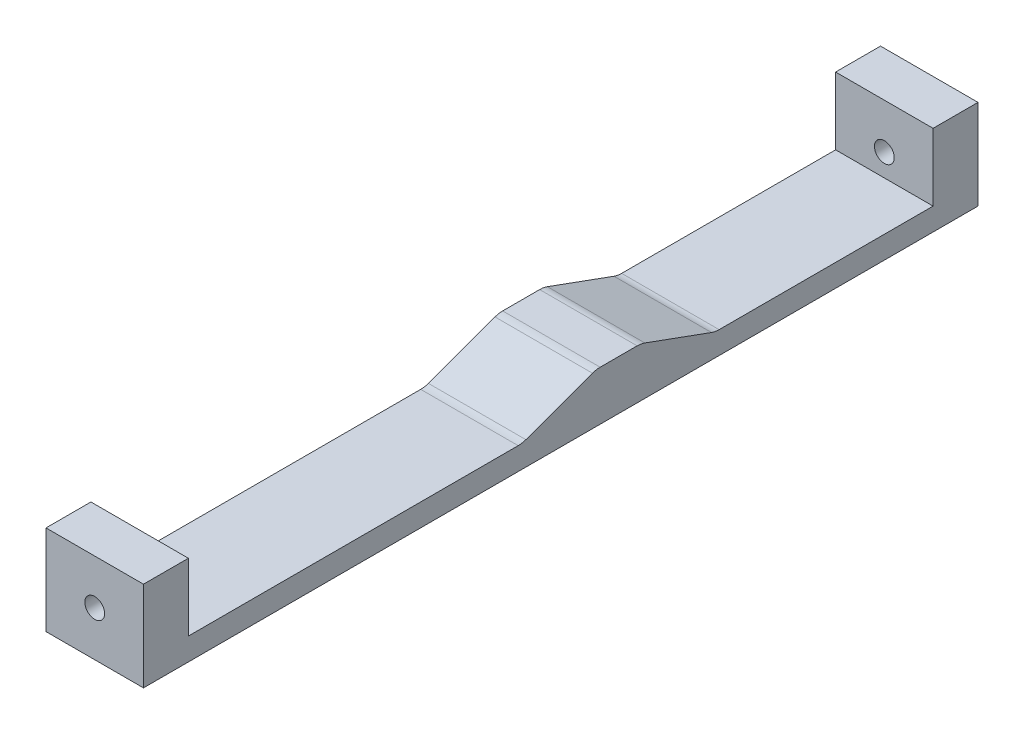
ISO-10303-21;
HEADER;
FILE_DESCRIPTION(('STEP AP214'),'2;1');
FILE_NAME('part.step','',(''),(''),'','','');
FILE_SCHEMA(('AUTOMOTIVE_DESIGN { 1 0 10303 214 1 1 1 1 }'));
ENDSEC;
DATA;
#1=APPLICATION_CONTEXT('core data for automotive mechanical design processes');
#2=APPLICATION_PROTOCOL_DEFINITION('international standard','automotive_design',2000,#1);
#3=PRODUCT_CONTEXT('',#1,'mechanical');
#4=PRODUCT('Part','Part','',(#3));
#5=PRODUCT_RELATED_PRODUCT_CATEGORY('part','',(#4));
#6=PRODUCT_DEFINITION_FORMATION('','',#4);
#7=PRODUCT_DEFINITION_CONTEXT('part definition',#1,'design');
#8=PRODUCT_DEFINITION('design','',#6,#7);
#9=PRODUCT_DEFINITION_SHAPE('','',#8);
#10=(LENGTH_UNIT() NAMED_UNIT(*) SI_UNIT(.MILLI.,.METRE.));
#11=(NAMED_UNIT(*) PLANE_ANGLE_UNIT() SI_UNIT($,.RADIAN.));
#12=(NAMED_UNIT(*) SI_UNIT($,.STERADIAN.) SOLID_ANGLE_UNIT());
#13=UNCERTAINTY_MEASURE_WITH_UNIT(LENGTH_MEASURE(1.E-05),#10,'distance_accuracy_value','');
#14=(GEOMETRIC_REPRESENTATION_CONTEXT(3) GLOBAL_UNCERTAINTY_ASSIGNED_CONTEXT((#13)) GLOBAL_UNIT_ASSIGNED_CONTEXT((#10,
#11,#12)) REPRESENTATION_CONTEXT('',''));
#15=CARTESIAN_POINT('',(0.,0.,0.));
#16=DIRECTION('',(0.,0.,1.));
#17=DIRECTION('',(1.,0.,0.));
#18=AXIS2_PLACEMENT_3D('',#15,#16,#17);
#19=CARTESIAN_POINT('',(0.,3.175,0.));
#20=DIRECTION('',(0.,-1.,0.));
#21=DIRECTION('',(0.,0.,-1.));
#22=AXIS2_PLACEMENT_3D('',#19,#20,#21);
#23=PLANE('',#22);
#24=DIRECTION('',(0.,0.,1.));
#25=VECTOR('',#24,1.);
#26=CARTESIAN_POINT('',(-6.88975,3.175,58.98650001));
#27=LINE('',#26,#25);
#28=CARTESIAN_POINT('',(-6.88975,3.175,-52.63650001));
#29=VERTEX_POINT('',#28);
#30=CARTESIAN_POINT('',(-6.88975,3.175,-22.3892271418717));
#31=VERTEX_POINT('',#30);
#32=EDGE_CURVE('E177',#29,#31,#27,.T.);
#33=ORIENTED_EDGE('',*,*,#32,.T.);
#34=DIRECTION('',(-1.,0.,0.));
#35=VECTOR('',#34,1.);
#36=CARTESIAN_POINT('',(0.,3.175,-22.3892271418717));
#37=LINE('',#36,#35);
#38=CARTESIAN_POINT('',(6.88975,3.175,-22.3892271418717));
#39=VERTEX_POINT('',#38);
#40=EDGE_CURVE('E263',#31,#39,#37,.F.);
#41=ORIENTED_EDGE('',*,*,#40,.T.);
#42=DIRECTION('',(0.,0.,-1.));
#43=VECTOR('',#42,1.);
#44=CARTESIAN_POINT('',(6.88975,3.175,58.98650001));
#45=LINE('',#44,#43);
#46=CARTESIAN_POINT('',(6.88975,3.175,-52.63650001));
#47=VERTEX_POINT('',#46);
#48=EDGE_CURVE('E213',#39,#47,#45,.T.);
#49=ORIENTED_EDGE('',*,*,#48,.T.);
#50=DIRECTION('',(1.,0.,0.));
#51=VECTOR('',#50,1.);
#52=CARTESIAN_POINT('',(-6.88975,3.175,-52.63650001));
#53=LINE('',#52,#51);
#54=EDGE_CURVE('E171',#29,#47,#53,.T.);
#55=ORIENTED_EDGE('',*,*,#54,.F.);
#56=EDGE_LOOP('',(#33,#41,#49,#55));
#57=FACE_BOUND('',#56,.T.);
#58=ADVANCED_FACE('F37',(#57),#23,.F.);
#59=CARTESIAN_POINT('',(6.88975,3.175,58.98650001));
#60=DIRECTION('',(-1.,0.,0.));
#61=DIRECTION('',(0.,0.,1.));
#62=AXIS2_PLACEMENT_3D('',#59,#60,#61);
#63=PLANE('',#62);
#64=DIRECTION('',(0.,0.,1.));
#65=VECTOR('',#64,1.);
#66=CARTESIAN_POINT('',(6.88975,6.985,-11.36150001));
#67=LINE('',#66,#65);
#68=CARTESIAN_POINT('',(6.88975,6.985,-10.8016618462506));
#69=VERTEX_POINT('',#68);
#70=CARTESIAN_POINT('',(6.88975,6.985,-5.57133817374936));
#71=VERTEX_POINT('',#70);
#72=EDGE_CURVE('E279',#69,#71,#67,.T.);
#73=ORIENTED_EDGE('',*,*,#72,.T.);
#74=CARTESIAN_POINT('',(6.88975,3.81,-5.57133817374936));
#75=DIRECTION('',(-1.,0.,0.));
#76=DIRECTION('',(0.,0.,1.));
#77=AXIS2_PLACEMENT_3D('',#74,#75,#76);
#78=CIRCLE('',#77,3.175);
#79=CARTESIAN_POINT('',(6.88975,6.79352407099527,-4.48542421869038));
#80=VERTEX_POINT('',#79);
#81=EDGE_CURVE('E257',#71,#80,#78,.F.);
#82=ORIENTED_EDGE('',*,*,#81,.T.);
#83=DIRECTION('',(0.,-0.342020143325663,0.939692620785911));
#84=VECTOR('',#83,1.);
#85=CARTESIAN_POINT('',(6.88975,3.175,5.45638895812232));
#86=LINE('',#85,#84);
#87=CARTESIAN_POINT('',(6.88975,3.36647592900473,4.93031316681271));
#88=VERTEX_POINT('',#87);
#89=EDGE_CURVE('E283',#80,#88,#86,.T.);
#90=ORIENTED_EDGE('',*,*,#89,.T.);
#91=CARTESIAN_POINT('',(6.88975,6.35,6.01622712187169));
#92=DIRECTION('',(-1.,0.,0.));
#93=DIRECTION('',(0.,0.,1.));
#94=AXIS2_PLACEMENT_3D('',#91,#92,#93);
#95=CIRCLE('',#94,3.175);
#96=CARTESIAN_POINT('',(6.88975,3.175,6.01622712187169));
#97=VERTEX_POINT('',#96);
#98=EDGE_CURVE('E267',#88,#97,#95,.T.);
#99=ORIENTED_EDGE('',*,*,#98,.T.);
#100=CARTESIAN_POINT('',(6.88975,3.175,52.63650001));
#101=VERTEX_POINT('',#100);
#102=EDGE_CURVE('E209',#101,#97,#45,.T.);
#103=ORIENTED_EDGE('',*,*,#102,.F.);
#104=DIRECTION('',(0.,1.,0.));
#105=VECTOR('',#104,1.);
#106=CARTESIAN_POINT('',(6.88975,3.175,52.63650001));
#107=LINE('',#106,#105);
#108=CARTESIAN_POINT('',(6.88975,12.7,52.63650001));
#109=VERTEX_POINT('',#108);
#110=EDGE_CURVE('E194',#101,#109,#107,.T.);
#111=ORIENTED_EDGE('',*,*,#110,.T.);
#112=DIRECTION('',(0.,0.,1.));
#113=VECTOR('',#112,1.);
#114=CARTESIAN_POINT('',(6.88975,12.7,52.63650001));
#115=LINE('',#114,#113);
#116=CARTESIAN_POINT('',(6.88975,12.7,58.98650001));
#117=VERTEX_POINT('',#116);
#118=EDGE_CURVE('E200',#109,#117,#115,.T.);
#119=ORIENTED_EDGE('',*,*,#118,.T.);
#120=DIRECTION('',(0.,-1.,0.));
#121=VECTOR('',#120,1.);
#122=CARTESIAN_POINT('',(6.88975,3.175,58.98650001));
#123=LINE('',#122,#121);
#124=CARTESIAN_POINT('',(6.88975,0.,58.98650001));
#125=VERTEX_POINT('',#124);
#126=EDGE_CURVE('E215',#117,#125,#123,.T.);
#127=ORIENTED_EDGE('',*,*,#126,.T.);
#128=DIRECTION('',(0.,0.,-1.));
#129=VECTOR('',#128,1.);
#130=CARTESIAN_POINT('',(6.88975,0.,58.98650001));
#131=LINE('',#130,#129);
#132=CARTESIAN_POINT('',(6.88975,0.,-58.98650001));
#133=VERTEX_POINT('',#132);
#134=EDGE_CURVE('E206',#125,#133,#131,.T.);
#135=ORIENTED_EDGE('',*,*,#134,.T.);
#136=DIRECTION('',(0.,-1.,0.));
#137=VECTOR('',#136,1.);
#138=CARTESIAN_POINT('',(6.88975,3.175,-58.98650001));
#139=LINE('',#138,#137);
#140=CARTESIAN_POINT('',(6.88975,12.7,-58.98650001));
#141=VERTEX_POINT('',#140);
#142=EDGE_CURVE('E231',#141,#133,#139,.T.);
#143=ORIENTED_EDGE('',*,*,#142,.F.);
#144=DIRECTION('',(0.,0.,-1.));
#145=VECTOR('',#144,1.);
#146=CARTESIAN_POINT('',(6.88975,12.7,-52.63650001));
#147=LINE('',#146,#145);
#148=CARTESIAN_POINT('',(6.88975,12.7,-52.63650001));
#149=VERTEX_POINT('',#148);
#150=EDGE_CURVE('E170',#149,#141,#147,.T.);
#151=ORIENTED_EDGE('',*,*,#150,.F.);
#152=DIRECTION('',(0.,1.,0.));
#153=VECTOR('',#152,1.);
#154=CARTESIAN_POINT('',(6.88975,3.175,-52.63650001));
#155=LINE('',#154,#153);
#156=EDGE_CURVE('E157',#47,#149,#155,.T.);
#157=ORIENTED_EDGE('',*,*,#156,.F.);
#158=ORIENTED_EDGE('',*,*,#48,.F.);
#159=CARTESIAN_POINT('',(6.88975,6.35,-22.3892271418717));
#160=DIRECTION('',(-1.,0.,0.));
#161=DIRECTION('',(0.,0.,1.));
#162=AXIS2_PLACEMENT_3D('',#159,#160,#161);
#163=CIRCLE('',#162,3.175);
#164=CARTESIAN_POINT('',(6.88975,3.36647592900473,-21.3033131868127));
#165=VERTEX_POINT('',#164);
#166=EDGE_CURVE('E11',#39,#165,#163,.T.);
#167=ORIENTED_EDGE('',*,*,#166,.T.);
#168=DIRECTION('',(0.,0.342020143325663,0.939692620785911));
#169=VECTOR('',#168,1.);
#170=CARTESIAN_POINT('',(6.88975,6.985,-11.36150001));
#171=LINE('',#170,#169);
#172=CARTESIAN_POINT('',(6.88975,6.79352407099527,-11.8875758013096));
#173=VERTEX_POINT('',#172);
#174=EDGE_CURVE('E276',#165,#173,#171,.T.);
#175=ORIENTED_EDGE('',*,*,#174,.T.);
#176=CARTESIAN_POINT('',(6.88975,3.81,-10.8016618462506));
#177=DIRECTION('',(-1.,0.,0.));
#178=DIRECTION('',(0.,0.,1.));
#179=AXIS2_PLACEMENT_3D('',#176,#177,#178);
#180=CIRCLE('',#179,3.175);
#181=EDGE_CURVE('E255',#173,#69,#180,.F.);
#182=ORIENTED_EDGE('',*,*,#181,.T.);
#183=EDGE_LOOP('',(#73,#82,#90,#99,#103,#111,#119,#127,#135,#143,#151,#157,#158,#167,#175,#182));
#184=FACE_BOUND('',#183,.T.);
#185=ADVANCED_FACE('F313',(#184),#63,.F.);
#186=CARTESIAN_POINT('',(-6.88975,3.175,-58.98650001));
#187=DIRECTION('',(0.,0.,1.));
#188=DIRECTION('',(1.,0.,0.));
#189=AXIS2_PLACEMENT_3D('',#186,#187,#188);
#190=PLANE('',#189);
#191=CARTESIAN_POINT('',(0.,6.35,-58.98650001));
#192=DIRECTION('',(0.,0.,1.));
#193=DIRECTION('',(1.,0.,0.));
#194=AXIS2_PLACEMENT_3D('',#191,#192,#193);
#195=CIRCLE('',#194,1.399999994);
#196=CARTESIAN_POINT('',(1.399999994,6.35,-58.98650001));
#197=VERTEX_POINT('',#196);
#198=EDGE_CURVE('E238',#197,#197,#195,.T.);
#199=ORIENTED_EDGE('',*,*,#198,.T.);
#200=EDGE_LOOP('',(#199));
#201=FACE_BOUND('',#200,.T.);
#202=DIRECTION('',(-1.,0.,0.));
#203=VECTOR('',#202,1.);
#204=CARTESIAN_POINT('',(-6.88975,0.,-58.98650001));
#205=LINE('',#204,#203);
#206=CARTESIAN_POINT('',(-6.88975,0.,-58.98650001));
#207=VERTEX_POINT('',#206);
#208=EDGE_CURVE('E218',#133,#207,#205,.T.);
#209=ORIENTED_EDGE('',*,*,#208,.T.);
#210=DIRECTION('',(0.,-1.,0.));
#211=VECTOR('',#210,1.);
#212=CARTESIAN_POINT('',(-6.88975,3.175,-58.98650001));
#213=LINE('',#212,#211);
#214=CARTESIAN_POINT('',(-6.88975,12.7,-58.98650001));
#215=VERTEX_POINT('',#214);
#216=EDGE_CURVE('E229',#215,#207,#213,.T.);
#217=ORIENTED_EDGE('',*,*,#216,.F.);
#218=DIRECTION('',(-1.,0.,0.));
#219=VECTOR('',#218,1.);
#220=CARTESIAN_POINT('',(-6.88975,12.7,-58.98650001));
#221=LINE('',#220,#219);
#222=EDGE_CURVE('E167',#141,#215,#221,.T.);
#223=ORIENTED_EDGE('',*,*,#222,.F.);
#224=ORIENTED_EDGE('',*,*,#142,.T.);
#225=EDGE_LOOP('',(#209,#217,#223,#224));
#226=FACE_BOUND('',#225,.T.);
#227=ADVANCED_FACE('F296',(#201,#226),#190,.F.);
#228=CARTESIAN_POINT('',(-6.88975,3.175,58.98650001));
#229=DIRECTION('',(1.,0.,0.));
#230=DIRECTION('',(0.,0.,-1.));
#231=AXIS2_PLACEMENT_3D('',#228,#229,#230);
#232=PLANE('',#231);
#233=DIRECTION('',(0.,0.342020143325663,-0.93969262078591));
#234=VECTOR('',#233,1.);
#235=CARTESIAN_POINT('',(-6.88975,3.175,5.45638895812232));
#236=LINE('',#235,#234);
#237=CARTESIAN_POINT('',(-6.88975,3.36647592900473,4.93031316681271));
#238=VERTEX_POINT('',#237);
#239=CARTESIAN_POINT('',(-6.88975,6.79352407099527,-4.48542421869038));
#240=VERTEX_POINT('',#239);
#241=EDGE_CURVE('E288',#238,#240,#236,.T.);
#242=ORIENTED_EDGE('',*,*,#241,.T.);
#243=CARTESIAN_POINT('',(-6.88975,3.81,-5.57133817374936));
#244=DIRECTION('',(1.,0.,0.));
#245=DIRECTION('',(0.,0.,-1.));
#246=AXIS2_PLACEMENT_3D('',#243,#244,#245);
#247=CIRCLE('',#246,3.175);
#248=CARTESIAN_POINT('',(-6.88975,6.985,-5.57133817374936));
#249=VERTEX_POINT('',#248);
#250=EDGE_CURVE('E248',#240,#249,#247,.F.);
#251=ORIENTED_EDGE('',*,*,#250,.T.);
#252=DIRECTION('',(0.,0.,-1.));
#253=VECTOR('',#252,1.);
#254=CARTESIAN_POINT('',(-6.88975,6.985,-11.36150001));
#255=LINE('',#254,#253);
#256=CARTESIAN_POINT('',(-6.88975,6.985,-10.8016618462506));
#257=VERTEX_POINT('',#256);
#258=EDGE_CURVE('E290',#249,#257,#255,.T.);
#259=ORIENTED_EDGE('',*,*,#258,.T.);
#260=CARTESIAN_POINT('',(-6.88975,3.81,-10.8016618462506));
#261=DIRECTION('',(1.,0.,0.));
#262=DIRECTION('',(0.,0.,-1.));
#263=AXIS2_PLACEMENT_3D('',#260,#261,#262);
#264=CIRCLE('',#263,3.175);
#265=CARTESIAN_POINT('',(-6.88975,6.79352407099527,-11.8875758013096));
#266=VERTEX_POINT('',#265);
#267=EDGE_CURVE('E246',#257,#266,#264,.F.);
#268=ORIENTED_EDGE('',*,*,#267,.T.);
#269=DIRECTION('',(0.,-0.342020143325663,-0.93969262078591));
#270=VECTOR('',#269,1.);
#271=CARTESIAN_POINT('',(-6.88975,6.985,-11.36150001));
#272=LINE('',#271,#270);
#273=CARTESIAN_POINT('',(-6.88975,3.36647592900473,-21.3033131868127));
#274=VERTEX_POINT('',#273);
#275=EDGE_CURVE('E269',#266,#274,#272,.T.);
#276=ORIENTED_EDGE('',*,*,#275,.T.);
#277=CARTESIAN_POINT('',(-6.88975,6.35,-22.3892271418717));
#278=DIRECTION('',(1.,0.,0.));
#279=DIRECTION('',(0.,0.,-1.));
#280=AXIS2_PLACEMENT_3D('',#277,#278,#279);
#281=CIRCLE('',#280,3.175);
#282=EDGE_CURVE('E45',#274,#31,#281,.T.);
#283=ORIENTED_EDGE('',*,*,#282,.T.);
#284=ORIENTED_EDGE('',*,*,#32,.F.);
#285=DIRECTION('',(0.,-1.,0.));
#286=VECTOR('',#285,1.);
#287=CARTESIAN_POINT('',(-6.88975,3.175,-52.63650001));
#288=LINE('',#287,#286);
#289=CARTESIAN_POINT('',(-6.88975,12.7,-52.63650001));
#290=VERTEX_POINT('',#289);
#291=EDGE_CURVE('E155',#290,#29,#288,.T.);
#292=ORIENTED_EDGE('',*,*,#291,.F.);
#293=DIRECTION('',(0.,0.,-1.));
#294=VECTOR('',#293,1.);
#295=CARTESIAN_POINT('',(-6.88975,12.7,-52.63650001));
#296=LINE('',#295,#294);
#297=EDGE_CURVE('E164',#290,#215,#296,.T.);
#298=ORIENTED_EDGE('',*,*,#297,.T.);
#299=ORIENTED_EDGE('',*,*,#216,.T.);
#300=DIRECTION('',(0.,0.,1.));
#301=VECTOR('',#300,1.);
#302=CARTESIAN_POINT('',(-6.88975,0.,58.98650001));
#303=LINE('',#302,#301);
#304=CARTESIAN_POINT('',(-6.88975,0.,58.98650001));
#305=VERTEX_POINT('',#304);
#306=EDGE_CURVE('E220',#207,#305,#303,.T.);
#307=ORIENTED_EDGE('',*,*,#306,.T.);
#308=DIRECTION('',(0.,-1.,0.));
#309=VECTOR('',#308,1.);
#310=CARTESIAN_POINT('',(-6.88975,3.175,58.98650001));
#311=LINE('',#310,#309);
#312=CARTESIAN_POINT('',(-6.88975,12.7,58.98650001));
#313=VERTEX_POINT('',#312);
#314=EDGE_CURVE('E226',#313,#305,#311,.T.);
#315=ORIENTED_EDGE('',*,*,#314,.F.);
#316=DIRECTION('',(0.,0.,1.));
#317=VECTOR('',#316,1.);
#318=CARTESIAN_POINT('',(-6.88975,12.7,52.63650001));
#319=LINE('',#318,#317);
#320=CARTESIAN_POINT('',(-6.88975,12.7,52.63650001));
#321=VERTEX_POINT('',#320);
#322=EDGE_CURVE('E203',#321,#313,#319,.T.);
#323=ORIENTED_EDGE('',*,*,#322,.F.);
#324=DIRECTION('',(0.,-1.,0.));
#325=VECTOR('',#324,1.);
#326=CARTESIAN_POINT('',(-6.88975,3.175,52.63650001));
#327=LINE('',#326,#325);
#328=CARTESIAN_POINT('',(-6.88975,3.175,52.63650001));
#329=VERTEX_POINT('',#328);
#330=EDGE_CURVE('E188',#321,#329,#327,.T.);
#331=ORIENTED_EDGE('',*,*,#330,.T.);
#332=CARTESIAN_POINT('',(-6.88975,3.175,6.01622712187169));
#333=VERTEX_POINT('',#332);
#334=EDGE_CURVE('E212',#333,#329,#27,.T.);
#335=ORIENTED_EDGE('',*,*,#334,.F.);
#336=CARTESIAN_POINT('',(-6.88975,6.35,6.01622712187169));
#337=DIRECTION('',(1.,0.,0.));
#338=DIRECTION('',(0.,0.,-1.));
#339=AXIS2_PLACEMENT_3D('',#336,#337,#338);
#340=CIRCLE('',#339,3.175);
#341=EDGE_CURVE('E265',#333,#238,#340,.T.);
#342=ORIENTED_EDGE('',*,*,#341,.T.);
#343=EDGE_LOOP('',(#242,#251,#259,#268,#276,#283,#284,#292,#298,#299,#307,#315,#323,#331,#335,#342));
#344=FACE_BOUND('',#343,.T.);
#345=ADVANCED_FACE('F175',(#344),#232,.F.);
#346=CARTESIAN_POINT('',(-6.88975,3.175,58.98650001));
#347=DIRECTION('',(0.,0.,-1.));
#348=DIRECTION('',(-1.,0.,0.));
#349=AXIS2_PLACEMENT_3D('',#346,#347,#348);
#350=PLANE('',#349);
#351=CARTESIAN_POINT('',(0.,6.35,58.98650001));
#352=DIRECTION('',(0.,0.,1.));
#353=DIRECTION('',(1.,0.,0.));
#354=AXIS2_PLACEMENT_3D('',#351,#352,#353);
#355=CIRCLE('',#354,1.399999994);
#356=CARTESIAN_POINT('',(1.399999994,6.35,58.98650001));
#357=VERTEX_POINT('',#356);
#358=EDGE_CURVE('E278',#357,#357,#355,.T.);
#359=ORIENTED_EDGE('',*,*,#358,.F.);
#360=EDGE_LOOP('',(#359));
#361=FACE_BOUND('',#360,.T.);
#362=DIRECTION('',(1.,0.,0.));
#363=VECTOR('',#362,1.);
#364=CARTESIAN_POINT('',(-6.88975,0.,58.98650001));
#365=LINE('',#364,#363);
#366=EDGE_CURVE('E222',#305,#125,#365,.T.);
#367=ORIENTED_EDGE('',*,*,#366,.T.);
#368=ORIENTED_EDGE('',*,*,#126,.F.);
#369=DIRECTION('',(-1.,0.,0.));
#370=VECTOR('',#369,1.);
#371=CARTESIAN_POINT('',(-6.88975,12.7,58.98650001));
#372=LINE('',#371,#370);
#373=EDGE_CURVE('E186',#117,#313,#372,.T.);
#374=ORIENTED_EDGE('',*,*,#373,.T.);
#375=ORIENTED_EDGE('',*,*,#314,.T.);
#376=EDGE_LOOP('',(#367,#368,#374,#375));
#377=FACE_BOUND('',#376,.T.);
#378=ADVANCED_FACE('F324',(#361,#377),#350,.F.);
#379=ORIENTED_EDGE('',*,*,#102,.T.);
#380=DIRECTION('',(-1.,0.,0.));
#381=VECTOR('',#380,1.);
#382=CARTESIAN_POINT('',(0.,3.175,6.01622712187169));
#383=LINE('',#382,#381);
#384=EDGE_CURVE('E234',#97,#333,#383,.T.);
#385=ORIENTED_EDGE('',*,*,#384,.T.);
#386=ORIENTED_EDGE('',*,*,#334,.T.);
#387=DIRECTION('',(1.,0.,0.));
#388=VECTOR('',#387,1.);
#389=CARTESIAN_POINT('',(-6.88975,3.175,52.63650001));
#390=LINE('',#389,#388);
#391=EDGE_CURVE('E191',#329,#101,#390,.T.);
#392=ORIENTED_EDGE('',*,*,#391,.T.);
#393=EDGE_LOOP('',(#379,#385,#386,#392));
#394=FACE_BOUND('',#393,.T.);
#395=ADVANCED_FACE('F315',(#394),#23,.F.);
#396=CARTESIAN_POINT('',(0.,0.,0.));
#397=DIRECTION('',(0.,-1.,0.));
#398=DIRECTION('',(0.,0.,-1.));
#399=AXIS2_PLACEMENT_3D('',#396,#397,#398);
#400=PLANE('',#399);
#401=ORIENTED_EDGE('',*,*,#134,.F.);
#402=ORIENTED_EDGE('',*,*,#366,.F.);
#403=ORIENTED_EDGE('',*,*,#306,.F.);
#404=ORIENTED_EDGE('',*,*,#208,.F.);
#405=EDGE_LOOP('',(#401,#402,#403,#404));
#406=FACE_BOUND('',#405,.T.);
#407=ADVANCED_FACE('F323',(#406),#400,.T.);
#408=CARTESIAN_POINT('',(-6.88975,12.7,52.63650001));
#409=DIRECTION('',(0.,1.,0.));
#410=DIRECTION('',(0.,0.,1.));
#411=AXIS2_PLACEMENT_3D('',#408,#409,#410);
#412=PLANE('',#411);
#413=ORIENTED_EDGE('',*,*,#373,.F.);
#414=ORIENTED_EDGE('',*,*,#118,.F.);
#415=DIRECTION('',(-1.,0.,0.));
#416=VECTOR('',#415,1.);
#417=CARTESIAN_POINT('',(-6.88975,12.7,52.63650001));
#418=LINE('',#417,#416);
#419=EDGE_CURVE('E197',#109,#321,#418,.T.);
#420=ORIENTED_EDGE('',*,*,#419,.T.);
#421=ORIENTED_EDGE('',*,*,#322,.T.);
#422=EDGE_LOOP('',(#413,#414,#420,#421));
#423=FACE_BOUND('',#422,.T.);
#424=ADVANCED_FACE('F330',(#423),#412,.T.);
#425=CARTESIAN_POINT('',(0.,0.,52.63650001));
#426=DIRECTION('',(0.,0.,-1.));
#427=DIRECTION('',(-1.,0.,0.));
#428=AXIS2_PLACEMENT_3D('',#425,#426,#427);
#429=PLANE('',#428);
#430=CARTESIAN_POINT('',(0.,6.35,52.63650001));
#431=DIRECTION('',(0.,0.,-1.));
#432=DIRECTION('',(-1.,0.,0.));
#433=AXIS2_PLACEMENT_3D('',#430,#431,#432);
#434=CIRCLE('',#433,1.399999994);
#435=CARTESIAN_POINT('',(-1.399999994,6.35,52.63650001));
#436=VERTEX_POINT('',#435);
#437=EDGE_CURVE('E179',#436,#436,#434,.T.);
#438=ORIENTED_EDGE('',*,*,#437,.F.);
#439=EDGE_LOOP('',(#438));
#440=FACE_BOUND('',#439,.T.);
#441=ORIENTED_EDGE('',*,*,#330,.F.);
#442=ORIENTED_EDGE('',*,*,#419,.F.);
#443=ORIENTED_EDGE('',*,*,#110,.F.);
#444=ORIENTED_EDGE('',*,*,#391,.F.);
#445=EDGE_LOOP('',(#441,#442,#443,#444));
#446=FACE_BOUND('',#445,.T.);
#447=ADVANCED_FACE('F392',(#440,#446),#429,.T.);
#448=CARTESIAN_POINT('',(-6.88975,12.7,-52.63650001));
#449=DIRECTION('',(0.,-1.,0.));
#450=DIRECTION('',(0.,0.,-1.));
#451=AXIS2_PLACEMENT_3D('',#448,#449,#450);
#452=PLANE('',#451);
#453=ORIENTED_EDGE('',*,*,#222,.T.);
#454=ORIENTED_EDGE('',*,*,#297,.F.);
#455=DIRECTION('',(-1.,0.,0.));
#456=VECTOR('',#455,1.);
#457=CARTESIAN_POINT('',(-6.88975,12.7,-52.63650001));
#458=LINE('',#457,#456);
#459=EDGE_CURVE('E150',#149,#290,#458,.T.);
#460=ORIENTED_EDGE('',*,*,#459,.F.);
#461=ORIENTED_EDGE('',*,*,#150,.T.);
#462=EDGE_LOOP('',(#453,#454,#460,#461));
#463=FACE_BOUND('',#462,.T.);
#464=ADVANCED_FACE('F165',(#463),#452,.F.);
#465=CARTESIAN_POINT('',(0.,0.,-52.63650001));
#466=DIRECTION('',(0.,0.,1.));
#467=DIRECTION('',(-1.,0.,0.));
#468=AXIS2_PLACEMENT_3D('',#465,#466,#467);
#469=PLANE('',#468);
#470=CARTESIAN_POINT('',(0.,6.35,-52.63650001));
#471=DIRECTION('',(0.,0.,1.));
#472=DIRECTION('',(1.,0.,0.));
#473=AXIS2_PLACEMENT_3D('',#470,#471,#472);
#474=CIRCLE('',#473,1.399999994);
#475=CARTESIAN_POINT('',(1.399999994,6.35,-52.63650001));
#476=VERTEX_POINT('',#475);
#477=EDGE_CURVE('E235',#476,#476,#474,.T.);
#478=ORIENTED_EDGE('',*,*,#477,.F.);
#479=EDGE_LOOP('',(#478));
#480=FACE_BOUND('',#479,.T.);
#481=ORIENTED_EDGE('',*,*,#291,.T.);
#482=ORIENTED_EDGE('',*,*,#54,.T.);
#483=ORIENTED_EDGE('',*,*,#156,.T.);
#484=ORIENTED_EDGE('',*,*,#459,.T.);
#485=EDGE_LOOP('',(#481,#482,#483,#484));
#486=FACE_BOUND('',#485,.T.);
#487=ADVANCED_FACE('F152',(#480,#486),#469,.T.);
#488=CARTESIAN_POINT('',(0.,6.35,-58.98650001));
#489=DIRECTION('',(0.,0.,1.));
#490=DIRECTION('',(1.,0.,0.));
#491=AXIS2_PLACEMENT_3D('',#488,#489,#490);
#492=CYLINDRICAL_SURFACE('',#491,1.399999994);
#493=ORIENTED_EDGE('',*,*,#477,.T.);
#494=EDGE_LOOP('',(#493));
#495=FACE_BOUND('',#494,.T.);
#496=ORIENTED_EDGE('',*,*,#198,.F.);
#497=EDGE_LOOP('',(#496));
#498=FACE_BOUND('',#497,.T.);
#499=ADVANCED_FACE('F299',(#495,#498),#492,.F.);
#500=ORIENTED_EDGE('',*,*,#437,.T.);
#501=EDGE_LOOP('',(#500));
#502=FACE_BOUND('',#501,.T.);
#503=ORIENTED_EDGE('',*,*,#358,.T.);
#504=EDGE_LOOP('',(#503));
#505=FACE_BOUND('',#504,.T.);
#506=ADVANCED_FACE('F301',(#502,#505),#492,.F.);
#507=CARTESIAN_POINT('',(34.4402450515604,6.985,-11.36150001));
#508=DIRECTION('',(0.,0.939692620785911,-0.342020143325663));
#509=DIRECTION('',(0.,0.342020143325663,0.939692620785911));
#510=AXIS2_PLACEMENT_3D('',#507,#508,#509);
#511=PLANE('',#510);
#512=ORIENTED_EDGE('',*,*,#174,.F.);
#513=DIRECTION('',(-1.,0.,0.));
#514=VECTOR('',#513,1.);
#515=CARTESIAN_POINT('',(34.4402450515604,3.36647592900473,-21.3033131868127));
#516=LINE('',#515,#514);
#517=EDGE_CURVE('E260',#165,#274,#516,.T.);
#518=ORIENTED_EDGE('',*,*,#517,.T.);
#519=ORIENTED_EDGE('',*,*,#275,.F.);
#520=DIRECTION('',(-1.,0.,0.));
#521=VECTOR('',#520,1.);
#522=CARTESIAN_POINT('',(34.4402450515604,6.79352407099527,-11.8875758013096));
#523=LINE('',#522,#521);
#524=EDGE_CURVE('E52',#266,#173,#523,.F.);
#525=ORIENTED_EDGE('',*,*,#524,.T.);
#526=EDGE_LOOP('',(#512,#518,#519,#525));
#527=FACE_BOUND('',#526,.T.);
#528=ADVANCED_FACE('F275',(#527),#511,.T.);
#529=CARTESIAN_POINT('',(34.4402450515604,6.985,-11.36150001));
#530=DIRECTION('',(0.,1.,0.));
#531=DIRECTION('',(0.,0.,1.));
#532=AXIS2_PLACEMENT_3D('',#529,#530,#531);
#533=PLANE('',#532);
#534=ORIENTED_EDGE('',*,*,#258,.F.);
#535=DIRECTION('',(-1.,0.,0.));
#536=VECTOR('',#535,1.);
#537=CARTESIAN_POINT('',(34.4402450515604,6.985,-5.57133817374936));
#538=LINE('',#537,#536);
#539=EDGE_CURVE('E253',#249,#71,#538,.F.);
#540=ORIENTED_EDGE('',*,*,#539,.T.);
#541=ORIENTED_EDGE('',*,*,#72,.F.);
#542=DIRECTION('',(-1.,0.,0.));
#543=VECTOR('',#542,1.);
#544=CARTESIAN_POINT('',(34.4402450515604,6.985,-10.8016618462506));
#545=LINE('',#544,#543);
#546=EDGE_CURVE('E250',#69,#257,#545,.T.);
#547=ORIENTED_EDGE('',*,*,#546,.T.);
#548=EDGE_LOOP('',(#534,#540,#541,#547));
#549=FACE_BOUND('',#548,.T.);
#550=ADVANCED_FACE('F354',(#549),#533,.T.);
#551=CARTESIAN_POINT('',(34.4402450515604,3.175,5.45638895812232));
#552=DIRECTION('',(0.,0.939692620785911,0.342020143325663));
#553=DIRECTION('',(0.,-0.342020143325663,0.939692620785911));
#554=AXIS2_PLACEMENT_3D('',#551,#552,#553);
#555=PLANE('',#554);
#556=ORIENTED_EDGE('',*,*,#241,.F.);
#557=DIRECTION('',(-1.,0.,0.));
#558=VECTOR('',#557,1.);
#559=CARTESIAN_POINT('',(34.4402450515604,3.36647592900473,4.93031316681271));
#560=LINE('',#559,#558);
#561=EDGE_CURVE('E244',#238,#88,#560,.F.);
#562=ORIENTED_EDGE('',*,*,#561,.T.);
#563=ORIENTED_EDGE('',*,*,#89,.F.);
#564=DIRECTION('',(-1.,0.,0.));
#565=VECTOR('',#564,1.);
#566=CARTESIAN_POINT('',(34.4402450515604,6.79352407099527,-4.48542421869038));
#567=LINE('',#566,#565);
#568=EDGE_CURVE('E241',#80,#240,#567,.T.);
#569=ORIENTED_EDGE('',*,*,#568,.T.);
#570=EDGE_LOOP('',(#556,#562,#563,#569));
#571=FACE_BOUND('',#570,.T.);
#572=ADVANCED_FACE('F344',(#571),#555,.T.);
#573=CARTESIAN_POINT('',(0.,6.35,6.01622712187169));
#574=DIRECTION('',(-1.,0.,0.));
#575=DIRECTION('',(0.,0.,1.));
#576=AXIS2_PLACEMENT_3D('',#573,#574,#575);
#577=CYLINDRICAL_SURFACE('',#576,3.175);
#578=ORIENTED_EDGE('',*,*,#98,.F.);
#579=ORIENTED_EDGE('',*,*,#561,.F.);
#580=ORIENTED_EDGE('',*,*,#341,.F.);
#581=ORIENTED_EDGE('',*,*,#384,.F.);
#582=EDGE_LOOP('',(#578,#579,#580,#581));
#583=FACE_BOUND('',#582,.T.);
#584=ADVANCED_FACE('F340',(#583),#577,.F.);
#585=CARTESIAN_POINT('',(34.4402450515604,3.81,-5.57133817374936));
#586=DIRECTION('',(-1.,0.,0.));
#587=DIRECTION('',(0.,0.,1.));
#588=AXIS2_PLACEMENT_3D('',#585,#586,#587);
#589=CYLINDRICAL_SURFACE('',#588,3.175);
#590=ORIENTED_EDGE('',*,*,#81,.F.);
#591=ORIENTED_EDGE('',*,*,#539,.F.);
#592=ORIENTED_EDGE('',*,*,#250,.F.);
#593=ORIENTED_EDGE('',*,*,#568,.F.);
#594=EDGE_LOOP('',(#590,#591,#592,#593));
#595=FACE_BOUND('',#594,.T.);
#596=ADVANCED_FACE('F350',(#595),#589,.T.);
#597=CARTESIAN_POINT('',(34.4402450515604,6.35,-22.3892271418717));
#598=DIRECTION('',(-1.,0.,0.));
#599=DIRECTION('',(0.,0.,1.));
#600=AXIS2_PLACEMENT_3D('',#597,#598,#599);
#601=CYLINDRICAL_SURFACE('',#600,3.175);
#602=ORIENTED_EDGE('',*,*,#166,.F.);
#603=ORIENTED_EDGE('',*,*,#40,.F.);
#604=ORIENTED_EDGE('',*,*,#282,.F.);
#605=ORIENTED_EDGE('',*,*,#517,.F.);
#606=EDGE_LOOP('',(#602,#603,#604,#605));
#607=FACE_BOUND('',#606,.T.);
#608=ADVANCED_FACE('F274',(#607),#601,.F.);
#609=CARTESIAN_POINT('',(34.4402450515604,3.81,-10.8016618462506));
#610=DIRECTION('',(-1.,0.,0.));
#611=DIRECTION('',(0.,0.,1.));
#612=AXIS2_PLACEMENT_3D('',#609,#610,#611);
#613=CYLINDRICAL_SURFACE('',#612,3.175);
#614=ORIENTED_EDGE('',*,*,#181,.F.);
#615=ORIENTED_EDGE('',*,*,#524,.F.);
#616=ORIENTED_EDGE('',*,*,#267,.F.);
#617=ORIENTED_EDGE('',*,*,#546,.F.);
#618=EDGE_LOOP('',(#614,#615,#616,#617));
#619=FACE_BOUND('',#618,.T.);
#620=ADVANCED_FACE('F39',(#619),#613,.T.);
#621=CLOSED_SHELL('',(#58,#185,#227,#345,#378,#395,#407,#424,#447,#464,#487,#499,#506,#528,#550,
#572,#584,#596,#608,#620));
#622=MANIFOLD_SOLID_BREP('B2',#621);
#623=ADVANCED_BREP_SHAPE_REPRESENTATION('',(#18,#622),#14);
#624=SHAPE_DEFINITION_REPRESENTATION(#9,#623);
ENDSEC;
END-ISO-10303-21;
